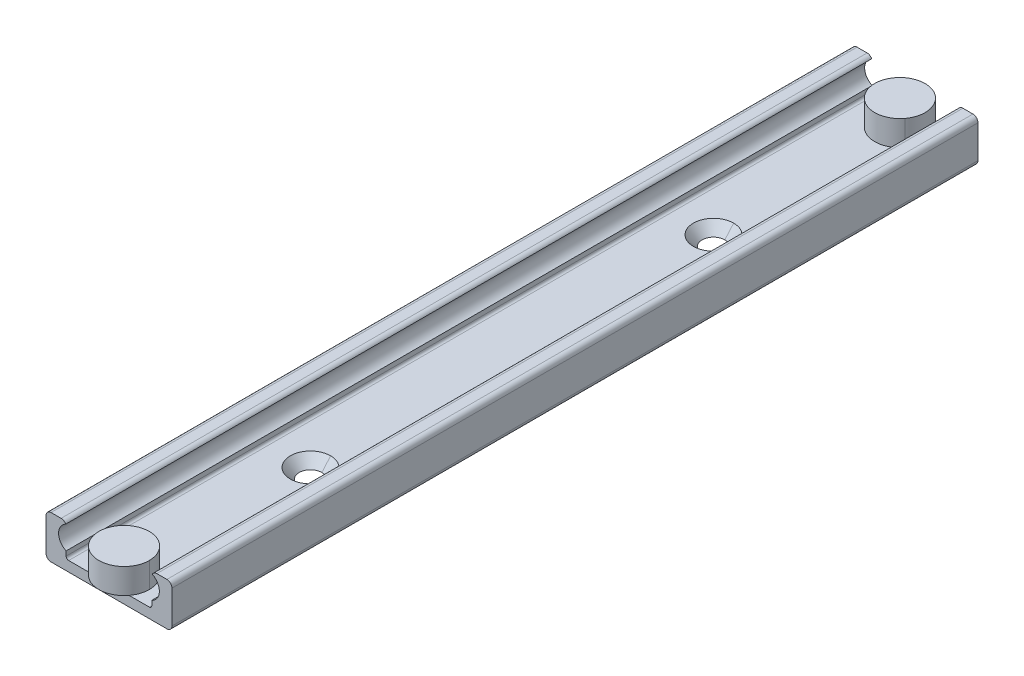
ISO-10303-21;
HEADER;
FILE_DESCRIPTION(('STEP AP214'),'2;1');
FILE_NAME('part.step','',(''),(''),'','','');
FILE_SCHEMA(('AUTOMOTIVE_DESIGN { 1 0 10303 214 1 1 1 1 }'));
ENDSEC;
DATA;
#1=APPLICATION_CONTEXT('core data for automotive mechanical design processes');
#2=APPLICATION_PROTOCOL_DEFINITION('international standard','automotive_design',2000,#1);
#3=PRODUCT_CONTEXT('',#1,'mechanical');
#4=PRODUCT('Part','Part','',(#3));
#5=PRODUCT_RELATED_PRODUCT_CATEGORY('part','',(#4));
#6=PRODUCT_DEFINITION_FORMATION('','',#4);
#7=PRODUCT_DEFINITION_CONTEXT('part definition',#1,'design');
#8=PRODUCT_DEFINITION('design','',#6,#7);
#9=PRODUCT_DEFINITION_SHAPE('','',#8);
#10=(LENGTH_UNIT() NAMED_UNIT(*) SI_UNIT(.MILLI.,.METRE.));
#11=(NAMED_UNIT(*) PLANE_ANGLE_UNIT() SI_UNIT($,.RADIAN.));
#12=(NAMED_UNIT(*) SI_UNIT($,.STERADIAN.) SOLID_ANGLE_UNIT());
#13=UNCERTAINTY_MEASURE_WITH_UNIT(LENGTH_MEASURE(1.E-05),#10,'distance_accuracy_value','');
#14=(GEOMETRIC_REPRESENTATION_CONTEXT(3) GLOBAL_UNCERTAINTY_ASSIGNED_CONTEXT((#13)) GLOBAL_UNIT_ASSIGNED_CONTEXT((#10,
#11,#12)) REPRESENTATION_CONTEXT('',''));
#15=CARTESIAN_POINT('',(0.,0.,0.));
#16=DIRECTION('',(0.,0.,1.));
#17=DIRECTION('',(1.,0.,0.));
#18=AXIS2_PLACEMENT_3D('',#15,#16,#17);
#19=CARTESIAN_POINT('',(-8.00000000000009,2.49999999999991,160.));
#20=DIRECTION('',(0.,0.,1.));
#21=DIRECTION('',(0.70710678118642,0.707106781186675,0.));
#22=AXIS2_PLACEMENT_3D('',#19,#20,#21);
#23=CYLINDRICAL_SURFACE('',#22,0.5);
#24=DIRECTION('',(0.,0.,-1.));
#25=VECTOR('',#24,1.);
#26=CARTESIAN_POINT('',(-8.,2.,160.));
#27=LINE('',#26,#25);
#28=CARTESIAN_POINT('',(-8.,2.,160.));
#29=VERTEX_POINT('',#28);
#30=CARTESIAN_POINT('',(-8.,2.,0.));
#31=VERTEX_POINT('',#30);
#32=EDGE_CURVE('E11',#29,#31,#27,.T.);
#33=ORIENTED_EDGE('',*,*,#32,.T.);
#34=CARTESIAN_POINT('',(-8.00000000000009,2.49999999999991,0.));
#35=DIRECTION('',(0.,0.,1.));
#36=DIRECTION('',(1.,0.,0.));
#37=AXIS2_PLACEMENT_3D('',#34,#35,#36);
#38=CIRCLE('',#37,0.5);
#39=CARTESIAN_POINT('',(-8.5,2.5,0.));
#40=VERTEX_POINT('',#39);
#41=EDGE_CURVE('E25',#40,#31,#38,.T.);
#42=ORIENTED_EDGE('',*,*,#41,.F.);
#43=DIRECTION('',(0.,0.,-1.));
#44=VECTOR('',#43,1.);
#45=CARTESIAN_POINT('',(-8.5,2.5,160.));
#46=LINE('',#45,#44);
#47=CARTESIAN_POINT('',(-8.5,2.5,160.));
#48=VERTEX_POINT('',#47);
#49=EDGE_CURVE('E586',#48,#40,#46,.T.);
#50=ORIENTED_EDGE('',*,*,#49,.F.);
#51=CARTESIAN_POINT('',(-8.00000000000009,2.49999999999991,160.));
#52=DIRECTION('',(0.,0.,1.));
#53=DIRECTION('',(1.,0.,0.));
#54=AXIS2_PLACEMENT_3D('',#51,#52,#53);
#55=CIRCLE('',#54,0.5);
#56=EDGE_CURVE('E582',#48,#29,#55,.T.);
#57=ORIENTED_EDGE('',*,*,#56,.T.);
#58=EDGE_LOOP('',(#33,#42,#50,#57));
#59=FACE_BOUND('',#58,.T.);
#60=ADVANCED_FACE('F17',(#59),#23,.F.);
#61=CARTESIAN_POINT('',(-11.5000000000008,0.999999999999223,160.));
#62=DIRECTION('',(0.,0.,1.));
#63=DIRECTION('',(1.,0.,0.));
#64=AXIS2_PLACEMENT_3D('',#61,#62,#63);
#65=PLANE('',#64);
#66=DIRECTION('',(0.,-1.,0.));
#67=VECTOR('',#66,1.);
#68=CARTESIAN_POINT('',(-12.5,7.5,160.));
#69=LINE('',#68,#67);
#70=CARTESIAN_POINT('',(-12.5,7.5,160.));
#71=VERTEX_POINT('',#70);
#72=CARTESIAN_POINT('',(-12.5,1.,160.));
#73=VERTEX_POINT('',#72);
#74=EDGE_CURVE('E578',#71,#73,#69,.T.);
#75=ORIENTED_EDGE('',*,*,#74,.T.);
#76=CARTESIAN_POINT('',(-11.5000000000008,0.999999999999223,160.));
#77=DIRECTION('',(0.,0.,1.));
#78=DIRECTION('',(1.,0.,0.));
#79=AXIS2_PLACEMENT_3D('',#76,#77,#78);
#80=CIRCLE('',#79,1.);
#81=CARTESIAN_POINT('',(-11.5,0.,160.));
#82=VERTEX_POINT('',#81);
#83=EDGE_CURVE('E574',#73,#82,#80,.T.);
#84=ORIENTED_EDGE('',*,*,#83,.T.);
#85=DIRECTION('',(1.,0.,0.));
#86=VECTOR('',#85,1.);
#87=CARTESIAN_POINT('',(-11.5,0.,160.));
#88=LINE('',#87,#86);
#89=CARTESIAN_POINT('',(11.5,0.,160.));
#90=VERTEX_POINT('',#89);
#91=EDGE_CURVE('E570',#82,#90,#88,.T.);
#92=ORIENTED_EDGE('',*,*,#91,.T.);
#93=CARTESIAN_POINT('',(11.5000000000008,0.999999999999223,160.));
#94=DIRECTION('',(0.,0.,1.));
#95=DIRECTION('',(1.,0.,0.));
#96=AXIS2_PLACEMENT_3D('',#93,#94,#95);
#97=CIRCLE('',#96,1.);
#98=CARTESIAN_POINT('',(12.5,1.,160.));
#99=VERTEX_POINT('',#98);
#100=EDGE_CURVE('E566',#90,#99,#97,.T.);
#101=ORIENTED_EDGE('',*,*,#100,.T.);
#102=DIRECTION('',(0.,1.,0.));
#103=VECTOR('',#102,1.);
#104=CARTESIAN_POINT('',(12.5,1.,160.));
#105=LINE('',#104,#103);
#106=CARTESIAN_POINT('',(12.5,7.5,160.));
#107=VERTEX_POINT('',#106);
#108=EDGE_CURVE('E562',#99,#107,#105,.T.);
#109=ORIENTED_EDGE('',*,*,#108,.T.);
#110=CARTESIAN_POINT('',(11.5000000000007,7.50000000000069,160.));
#111=DIRECTION('',(0.,0.,1.));
#112=DIRECTION('',(1.,0.,0.));
#113=AXIS2_PLACEMENT_3D('',#110,#111,#112);
#114=CIRCLE('',#113,1.);
#115=CARTESIAN_POINT('',(11.5,8.5,160.));
#116=VERTEX_POINT('',#115);
#117=EDGE_CURVE('E558',#107,#116,#114,.T.);
#118=ORIENTED_EDGE('',*,*,#117,.T.);
#119=DIRECTION('',(-1.,0.,0.));
#120=VECTOR('',#119,1.);
#121=CARTESIAN_POINT('',(11.5,8.5,160.));
#122=LINE('',#121,#120);
#123=CARTESIAN_POINT('',(9.5,8.5,160.));
#124=VERTEX_POINT('',#123);
#125=EDGE_CURVE('E554',#116,#124,#122,.T.);
#126=ORIENTED_EDGE('',*,*,#125,.T.);
#127=CARTESIAN_POINT('',(9.50000000000006,7.5,160.));
#128=DIRECTION('',(0.,0.,1.));
#129=DIRECTION('',(1.,0.,0.));
#130=AXIS2_PLACEMENT_3D('',#127,#128,#129);
#131=CIRCLE('',#130,1.);
#132=CARTESIAN_POINT('',(8.6035924033162,7.943230662982,160.));
#133=VERTEX_POINT('',#132);
#134=EDGE_CURVE('E550',#124,#133,#131,.T.);
#135=ORIENTED_EDGE('',*,*,#134,.T.);
#136=CARTESIAN_POINT('',(7.49999999999998,5.7,160.));
#137=DIRECTION('',(0.,0.,1.));
#138=DIRECTION('',(1.,0.,0.));
#139=AXIS2_PLACEMENT_3D('',#136,#137,#138);
#140=CIRCLE('',#139,2.5);
#141=CARTESIAN_POINT('',(8.5,3.4087121525221,160.));
#142=VERTEX_POINT('',#141);
#143=EDGE_CURVE('E545',#142,#133,#140,.T.);
#144=ORIENTED_EDGE('',*,*,#143,.F.);
#145=DIRECTION('',(0.,-1.,0.));
#146=VECTOR('',#145,1.);
#147=CARTESIAN_POINT('',(8.5,3.4087121525221,160.));
#148=LINE('',#147,#146);
#149=CARTESIAN_POINT('',(8.5,2.5,160.));
#150=VERTEX_POINT('',#149);
#151=EDGE_CURVE('E541',#142,#150,#148,.T.);
#152=ORIENTED_EDGE('',*,*,#151,.T.);
#153=CARTESIAN_POINT('',(8.00000000000009,2.49999999999991,160.));
#154=DIRECTION('',(0.,0.,1.));
#155=DIRECTION('',(1.,0.,0.));
#156=AXIS2_PLACEMENT_3D('',#153,#154,#155);
#157=CIRCLE('',#156,0.5);
#158=CARTESIAN_POINT('',(8.,2.,160.));
#159=VERTEX_POINT('',#158);
#160=EDGE_CURVE('E536',#159,#150,#157,.T.);
#161=ORIENTED_EDGE('',*,*,#160,.F.);
#162=DIRECTION('',(-1.,0.,0.));
#163=VECTOR('',#162,1.);
#164=CARTESIAN_POINT('',(8.,2.,160.));
#165=LINE('',#164,#163);
#166=CARTESIAN_POINT('',(4.,2.,160.));
#167=VERTEX_POINT('',#166);
#168=EDGE_CURVE('E532',#159,#167,#165,.T.);
#169=ORIENTED_EDGE('',*,*,#168,.T.);
#170=DIRECTION('',(-1.,0.,0.));
#171=VECTOR('',#170,1.);
#172=CARTESIAN_POINT('',(8.,2.,160.));
#173=LINE('',#172,#171);
#174=CARTESIAN_POINT('',(-4.,2.,160.));
#175=VERTEX_POINT('',#174);
#176=EDGE_CURVE('E528',#167,#175,#173,.T.);
#177=ORIENTED_EDGE('',*,*,#176,.T.);
#178=DIRECTION('',(-1.,0.,0.));
#179=VECTOR('',#178,1.);
#180=CARTESIAN_POINT('',(8.,2.,160.));
#181=LINE('',#180,#179);
#182=EDGE_CURVE('E523',#175,#29,#181,.T.);
#183=ORIENTED_EDGE('',*,*,#182,.T.);
#184=ORIENTED_EDGE('',*,*,#56,.F.);
#185=DIRECTION('',(0.,1.,0.));
#186=VECTOR('',#185,1.);
#187=CARTESIAN_POINT('',(-8.5,2.5,160.));
#188=LINE('',#187,#186);
#189=CARTESIAN_POINT('',(-8.5,3.4087121525221,160.));
#190=VERTEX_POINT('',#189);
#191=EDGE_CURVE('E519',#48,#190,#188,.T.);
#192=ORIENTED_EDGE('',*,*,#191,.T.);
#193=CARTESIAN_POINT('',(-7.49999999999998,5.7,160.));
#194=DIRECTION('',(0.,0.,1.));
#195=DIRECTION('',(1.,0.,0.));
#196=AXIS2_PLACEMENT_3D('',#193,#194,#195);
#197=CIRCLE('',#196,2.5);
#198=CARTESIAN_POINT('',(-8.6035924033162,7.943230662982,160.));
#199=VERTEX_POINT('',#198);
#200=EDGE_CURVE('E514',#199,#190,#197,.T.);
#201=ORIENTED_EDGE('',*,*,#200,.F.);
#202=CARTESIAN_POINT('',(-9.50000000000006,7.5,160.));
#203=DIRECTION('',(0.,0.,1.));
#204=DIRECTION('',(1.,0.,0.));
#205=AXIS2_PLACEMENT_3D('',#202,#203,#204);
#206=CIRCLE('',#205,1.);
#207=CARTESIAN_POINT('',(-9.5,8.5,160.));
#208=VERTEX_POINT('',#207);
#209=EDGE_CURVE('E510',#199,#208,#206,.T.);
#210=ORIENTED_EDGE('',*,*,#209,.T.);
#211=DIRECTION('',(-1.,0.,0.));
#212=VECTOR('',#211,1.);
#213=CARTESIAN_POINT('',(-9.5,8.5,160.));
#214=LINE('',#213,#212);
#215=CARTESIAN_POINT('',(-11.5,8.5,160.));
#216=VERTEX_POINT('',#215);
#217=EDGE_CURVE('E506',#208,#216,#214,.T.);
#218=ORIENTED_EDGE('',*,*,#217,.T.);
#219=CARTESIAN_POINT('',(-11.5000000000007,7.50000000000069,160.));
#220=DIRECTION('',(0.,0.,1.));
#221=DIRECTION('',(1.,0.,0.));
#222=AXIS2_PLACEMENT_3D('',#219,#220,#221);
#223=CIRCLE('',#222,1.);
#224=EDGE_CURVE('E502',#216,#71,#223,.T.);
#225=ORIENTED_EDGE('',*,*,#224,.T.);
#226=EDGE_LOOP('',(#75,#84,#92,#101,#109,#118,#126,#135,#144,#152,#161,#169,#177,#183,#184,#192,
#201,#210,#218,#225));
#227=FACE_BOUND('',#226,.T.);
#228=ADVANCED_FACE('F678',(#227),#65,.T.);
#229=CARTESIAN_POINT('',(-11.5000000000007,7.50000000000069,160.));
#230=DIRECTION('',(0.,0.,1.));
#231=DIRECTION('',(0.707106781186544,-0.707106781186551,0.));
#232=AXIS2_PLACEMENT_3D('',#229,#230,#231);
#233=CYLINDRICAL_SURFACE('',#232,1.);
#234=CARTESIAN_POINT('',(-11.5000000000007,7.50000000000069,0.));
#235=DIRECTION('',(0.,0.,1.));
#236=DIRECTION('',(1.,0.,0.));
#237=AXIS2_PLACEMENT_3D('',#234,#235,#236);
#238=CIRCLE('',#237,1.);
#239=CARTESIAN_POINT('',(-11.5,8.5,0.));
#240=VERTEX_POINT('',#239);
#241=CARTESIAN_POINT('',(-12.5,7.5,0.));
#242=VERTEX_POINT('',#241);
#243=EDGE_CURVE('E498',#240,#242,#238,.T.);
#244=ORIENTED_EDGE('',*,*,#243,.T.);
#245=DIRECTION('',(0.,0.,-1.));
#246=VECTOR('',#245,1.);
#247=CARTESIAN_POINT('',(-12.5,7.5,160.));
#248=LINE('',#247,#246);
#249=EDGE_CURVE('E493',#71,#242,#248,.T.);
#250=ORIENTED_EDGE('',*,*,#249,.F.);
#251=ORIENTED_EDGE('',*,*,#224,.F.);
#252=DIRECTION('',(0.,0.,-1.));
#253=VECTOR('',#252,1.);
#254=CARTESIAN_POINT('',(-11.5,8.5,160.));
#255=LINE('',#254,#253);
#256=EDGE_CURVE('E489',#216,#240,#255,.T.);
#257=ORIENTED_EDGE('',*,*,#256,.T.);
#258=EDGE_LOOP('',(#244,#250,#251,#257));
#259=FACE_BOUND('',#258,.T.);
#260=ADVANCED_FACE('F659',(#259),#233,.T.);
#261=CARTESIAN_POINT('',(-9.5,8.5,160.));
#262=DIRECTION('',(0.,-1.,0.));
#263=DIRECTION('',(0.,0.,-1.));
#264=AXIS2_PLACEMENT_3D('',#261,#262,#263);
#265=PLANE('',#264);
#266=DIRECTION('',(-1.,0.,0.));
#267=VECTOR('',#266,1.);
#268=CARTESIAN_POINT('',(-9.5,8.5,0.));
#269=LINE('',#268,#267);
#270=CARTESIAN_POINT('',(-9.5,8.5,0.));
#271=VERTEX_POINT('',#270);
#272=EDGE_CURVE('E484',#271,#240,#269,.T.);
#273=ORIENTED_EDGE('',*,*,#272,.T.);
#274=ORIENTED_EDGE('',*,*,#256,.F.);
#275=ORIENTED_EDGE('',*,*,#217,.F.);
#276=DIRECTION('',(0.,0.,-1.));
#277=VECTOR('',#276,1.);
#278=CARTESIAN_POINT('',(-9.5,8.5,160.));
#279=LINE('',#278,#277);
#280=EDGE_CURVE('E480',#208,#271,#279,.T.);
#281=ORIENTED_EDGE('',*,*,#280,.T.);
#282=EDGE_LOOP('',(#273,#274,#275,#281));
#283=FACE_BOUND('',#282,.T.);
#284=ADVANCED_FACE('F664',(#283),#265,.F.);
#285=CARTESIAN_POINT('',(-9.50000000000006,7.5,160.));
#286=DIRECTION('',(0.,0.,1.));
#287=DIRECTION('',(-0.527621709664251,-0.849479447362309,0.));
#288=AXIS2_PLACEMENT_3D('',#285,#286,#287);
#289=CYLINDRICAL_SURFACE('',#288,1.);
#290=CARTESIAN_POINT('',(-9.50000000000006,7.5,0.));
#291=DIRECTION('',(0.,0.,1.));
#292=DIRECTION('',(1.,0.,0.));
#293=AXIS2_PLACEMENT_3D('',#290,#291,#292);
#294=CIRCLE('',#293,1.);
#295=CARTESIAN_POINT('',(-8.6035924033162,7.943230662982,0.));
#296=VERTEX_POINT('',#295);
#297=EDGE_CURVE('E475',#296,#271,#294,.T.);
#298=ORIENTED_EDGE('',*,*,#297,.T.);
#299=ORIENTED_EDGE('',*,*,#280,.F.);
#300=ORIENTED_EDGE('',*,*,#209,.F.);
#301=DIRECTION('',(0.,0.,-1.));
#302=VECTOR('',#301,1.);
#303=CARTESIAN_POINT('',(-8.6035924033162,7.943230662982,160.));
#304=LINE('',#303,#302);
#305=EDGE_CURVE('E471',#199,#296,#304,.T.);
#306=ORIENTED_EDGE('',*,*,#305,.T.);
#307=EDGE_LOOP('',(#298,#299,#300,#306));
#308=FACE_BOUND('',#307,.T.);
#309=ADVANCED_FACE('F668',(#308),#289,.T.);
#310=CARTESIAN_POINT('',(-7.49999999999998,5.7,160.));
#311=DIRECTION('',(0.,0.,1.));
#312=DIRECTION('',(0.999739148398091,0.0228393336211892,0.));
#313=AXIS2_PLACEMENT_3D('',#310,#311,#312);
#314=CYLINDRICAL_SURFACE('',#313,2.5);
#315=DIRECTION('',(0.,0.,-1.));
#316=VECTOR('',#315,1.);
#317=CARTESIAN_POINT('',(-8.5,3.4087121525221,160.));
#318=LINE('',#317,#316);
#319=CARTESIAN_POINT('',(-8.5,3.4087121525221,0.));
#320=VERTEX_POINT('',#319);
#321=EDGE_CURVE('E467',#190,#320,#318,.T.);
#322=ORIENTED_EDGE('',*,*,#321,.T.);
#323=CARTESIAN_POINT('',(-7.49999999999998,5.7,0.));
#324=DIRECTION('',(0.,0.,1.));
#325=DIRECTION('',(1.,0.,0.));
#326=AXIS2_PLACEMENT_3D('',#323,#324,#325);
#327=CIRCLE('',#326,2.5);
#328=EDGE_CURVE('E462',#296,#320,#327,.T.);
#329=ORIENTED_EDGE('',*,*,#328,.F.);
#330=ORIENTED_EDGE('',*,*,#305,.F.);
#331=ORIENTED_EDGE('',*,*,#200,.T.);
#332=EDGE_LOOP('',(#322,#329,#330,#331));
#333=FACE_BOUND('',#332,.T.);
#334=ADVANCED_FACE('F711',(#333),#314,.F.);
#335=CARTESIAN_POINT('',(-11.5000000000008,0.999999999999223,0.));
#336=DIRECTION('',(0.,0.,1.));
#337=DIRECTION('',(1.,0.,0.));
#338=AXIS2_PLACEMENT_3D('',#335,#336,#337);
#339=PLANE('',#338);
#340=DIRECTION('',(0.,-1.,0.));
#341=VECTOR('',#340,1.);
#342=CARTESIAN_POINT('',(-12.5,7.5,0.));
#343=LINE('',#342,#341);
#344=CARTESIAN_POINT('',(-12.5,1.,0.));
#345=VERTEX_POINT('',#344);
#346=EDGE_CURVE('E457',#242,#345,#343,.T.);
#347=ORIENTED_EDGE('',*,*,#346,.F.);
#348=ORIENTED_EDGE('',*,*,#243,.F.);
#349=ORIENTED_EDGE('',*,*,#272,.F.);
#350=ORIENTED_EDGE('',*,*,#297,.F.);
#351=ORIENTED_EDGE('',*,*,#328,.T.);
#352=DIRECTION('',(0.,1.,0.));
#353=VECTOR('',#352,1.);
#354=CARTESIAN_POINT('',(-8.5,2.5,0.));
#355=LINE('',#354,#353);
#356=EDGE_CURVE('E452',#40,#320,#355,.T.);
#357=ORIENTED_EDGE('',*,*,#356,.F.);
#358=ORIENTED_EDGE('',*,*,#41,.T.);
#359=DIRECTION('',(-1.,0.,0.));
#360=VECTOR('',#359,1.);
#361=CARTESIAN_POINT('',(8.,2.,0.));
#362=LINE('',#361,#360);
#363=CARTESIAN_POINT('',(-4.,2.,0.));
#364=VERTEX_POINT('',#363);
#365=EDGE_CURVE('E447',#364,#31,#362,.T.);
#366=ORIENTED_EDGE('',*,*,#365,.F.);
#367=DIRECTION('',(-1.,0.,0.));
#368=VECTOR('',#367,1.);
#369=CARTESIAN_POINT('',(8.,2.,0.));
#370=LINE('',#369,#368);
#371=CARTESIAN_POINT('',(4.,2.,0.));
#372=VERTEX_POINT('',#371);
#373=EDGE_CURVE('E442',#372,#364,#370,.T.);
#374=ORIENTED_EDGE('',*,*,#373,.F.);
#375=DIRECTION('',(-1.,0.,0.));
#376=VECTOR('',#375,1.);
#377=CARTESIAN_POINT('',(8.,2.,0.));
#378=LINE('',#377,#376);
#379=CARTESIAN_POINT('',(8.,2.,0.));
#380=VERTEX_POINT('',#379);
#381=EDGE_CURVE('E437',#380,#372,#378,.T.);
#382=ORIENTED_EDGE('',*,*,#381,.F.);
#383=CARTESIAN_POINT('',(8.00000000000009,2.49999999999991,0.));
#384=DIRECTION('',(0.,0.,1.));
#385=DIRECTION('',(1.,0.,0.));
#386=AXIS2_PLACEMENT_3D('',#383,#384,#385);
#387=CIRCLE('',#386,0.5);
#388=CARTESIAN_POINT('',(8.5,2.5,0.));
#389=VERTEX_POINT('',#388);
#390=EDGE_CURVE('E433',#380,#389,#387,.T.);
#391=ORIENTED_EDGE('',*,*,#390,.T.);
#392=DIRECTION('',(0.,-1.,0.));
#393=VECTOR('',#392,1.);
#394=CARTESIAN_POINT('',(8.5,3.4087121525221,0.));
#395=LINE('',#394,#393);
#396=CARTESIAN_POINT('',(8.5,3.4087121525221,0.));
#397=VERTEX_POINT('',#396);
#398=EDGE_CURVE('E428',#397,#389,#395,.T.);
#399=ORIENTED_EDGE('',*,*,#398,.F.);
#400=CARTESIAN_POINT('',(7.49999999999998,5.7,0.));
#401=DIRECTION('',(0.,0.,1.));
#402=DIRECTION('',(1.,0.,0.));
#403=AXIS2_PLACEMENT_3D('',#400,#401,#402);
#404=CIRCLE('',#403,2.5);
#405=CARTESIAN_POINT('',(8.6035924033162,7.943230662982,0.));
#406=VERTEX_POINT('',#405);
#407=EDGE_CURVE('E424',#397,#406,#404,.T.);
#408=ORIENTED_EDGE('',*,*,#407,.T.);
#409=CARTESIAN_POINT('',(9.50000000000006,7.5,0.));
#410=DIRECTION('',(0.,0.,1.));
#411=DIRECTION('',(1.,0.,0.));
#412=AXIS2_PLACEMENT_3D('',#409,#410,#411);
#413=CIRCLE('',#412,1.);
#414=CARTESIAN_POINT('',(9.5,8.5,0.));
#415=VERTEX_POINT('',#414);
#416=EDGE_CURVE('E419',#415,#406,#413,.T.);
#417=ORIENTED_EDGE('',*,*,#416,.F.);
#418=DIRECTION('',(-1.,0.,0.));
#419=VECTOR('',#418,1.);
#420=CARTESIAN_POINT('',(11.5,8.5,0.));
#421=LINE('',#420,#419);
#422=CARTESIAN_POINT('',(11.5,8.5,0.));
#423=VERTEX_POINT('',#422);
#424=EDGE_CURVE('E414',#423,#415,#421,.T.);
#425=ORIENTED_EDGE('',*,*,#424,.F.);
#426=CARTESIAN_POINT('',(11.5000000000007,7.50000000000069,0.));
#427=DIRECTION('',(0.,0.,1.));
#428=DIRECTION('',(1.,0.,0.));
#429=AXIS2_PLACEMENT_3D('',#426,#427,#428);
#430=CIRCLE('',#429,1.);
#431=CARTESIAN_POINT('',(12.5,7.5,0.));
#432=VERTEX_POINT('',#431);
#433=EDGE_CURVE('E409',#432,#423,#430,.T.);
#434=ORIENTED_EDGE('',*,*,#433,.F.);
#435=DIRECTION('',(0.,1.,0.));
#436=VECTOR('',#435,1.);
#437=CARTESIAN_POINT('',(12.5,1.,0.));
#438=LINE('',#437,#436);
#439=CARTESIAN_POINT('',(12.5,1.,0.));
#440=VERTEX_POINT('',#439);
#441=EDGE_CURVE('E404',#440,#432,#438,.T.);
#442=ORIENTED_EDGE('',*,*,#441,.F.);
#443=CARTESIAN_POINT('',(11.5000000000008,0.999999999999223,0.));
#444=DIRECTION('',(0.,0.,1.));
#445=DIRECTION('',(1.,0.,0.));
#446=AXIS2_PLACEMENT_3D('',#443,#444,#445);
#447=CIRCLE('',#446,1.);
#448=CARTESIAN_POINT('',(11.5,0.,0.));
#449=VERTEX_POINT('',#448);
#450=EDGE_CURVE('E399',#449,#440,#447,.T.);
#451=ORIENTED_EDGE('',*,*,#450,.F.);
#452=DIRECTION('',(1.,0.,0.));
#453=VECTOR('',#452,1.);
#454=CARTESIAN_POINT('',(-11.5,0.,0.));
#455=LINE('',#454,#453);
#456=CARTESIAN_POINT('',(-11.5,0.,0.));
#457=VERTEX_POINT('',#456);
#458=EDGE_CURVE('E394',#457,#449,#455,.T.);
#459=ORIENTED_EDGE('',*,*,#458,.F.);
#460=CARTESIAN_POINT('',(-11.5000000000008,0.999999999999223,0.));
#461=DIRECTION('',(0.,0.,1.));
#462=DIRECTION('',(1.,0.,0.));
#463=AXIS2_PLACEMENT_3D('',#460,#461,#462);
#464=CIRCLE('',#463,1.);
#465=EDGE_CURVE('E389',#345,#457,#464,.T.);
#466=ORIENTED_EDGE('',*,*,#465,.F.);
#467=EDGE_LOOP('',(#347,#348,#349,#350,#351,#357,#358,#366,#374,#382,#391,#399,#408,#417,#425,
#434,#442,#451,#459,#466));
#468=FACE_BOUND('',#467,.T.);
#469=ADVANCED_FACE('F597',(#468),#339,.F.);
#470=CARTESIAN_POINT('',(-11.5000000000008,0.999999999999223,160.));
#471=DIRECTION('',(0.,0.,1.));
#472=DIRECTION('',(0.70710678118599,0.707106781187105,0.));
#473=AXIS2_PLACEMENT_3D('',#470,#471,#472);
#474=CYLINDRICAL_SURFACE('',#473,1.);
#475=ORIENTED_EDGE('',*,*,#465,.T.);
#476=DIRECTION('',(0.,0.,-1.));
#477=VECTOR('',#476,1.);
#478=CARTESIAN_POINT('',(-11.5,0.,160.));
#479=LINE('',#478,#477);
#480=EDGE_CURVE('E384',#82,#457,#479,.T.);
#481=ORIENTED_EDGE('',*,*,#480,.F.);
#482=ORIENTED_EDGE('',*,*,#83,.F.);
#483=DIRECTION('',(0.,0.,-1.));
#484=VECTOR('',#483,1.);
#485=CARTESIAN_POINT('',(-12.5,1.,160.));
#486=LINE('',#485,#484);
#487=EDGE_CURVE('E379',#73,#345,#486,.T.);
#488=ORIENTED_EDGE('',*,*,#487,.T.);
#489=EDGE_LOOP('',(#475,#481,#482,#488));
#490=FACE_BOUND('',#489,.T.);
#491=ADVANCED_FACE('F648',(#490),#474,.T.);
#492=CARTESIAN_POINT('',(-12.5,7.5,160.));
#493=DIRECTION('',(1.,0.,0.));
#494=DIRECTION('',(0.,0.,-1.));
#495=AXIS2_PLACEMENT_3D('',#492,#493,#494);
#496=PLANE('',#495);
#497=ORIENTED_EDGE('',*,*,#346,.T.);
#498=ORIENTED_EDGE('',*,*,#487,.F.);
#499=ORIENTED_EDGE('',*,*,#74,.F.);
#500=ORIENTED_EDGE('',*,*,#249,.T.);
#501=EDGE_LOOP('',(#497,#498,#499,#500));
#502=FACE_BOUND('',#501,.T.);
#503=ADVANCED_FACE('F653',(#502),#496,.F.);
#504=CARTESIAN_POINT('',(-11.5,0.,160.));
#505=DIRECTION('',(0.,1.,0.));
#506=DIRECTION('',(0.,0.,1.));
#507=AXIS2_PLACEMENT_3D('',#504,#505,#506);
#508=PLANE('',#507);
#509=CARTESIAN_POINT('',(0.,0.,120.));
#510=DIRECTION('',(0.,-1.,0.));
#511=DIRECTION('',(0.,0.,-1.));
#512=AXIS2_PLACEMENT_3D('',#509,#510,#511);
#513=CIRCLE('',#512,2.25);
#514=CARTESIAN_POINT('',(0.,0.,117.75));
#515=VERTEX_POINT('',#514);
#516=CARTESIAN_POINT('',(0.,-3.78430620173731E-11,122.250000000043));
#517=VERTEX_POINT('',#516);
#518=EDGE_CURVE('E374',#515,#517,#513,.T.);
#519=ORIENTED_EDGE('',*,*,#518,.F.);
#520=CARTESIAN_POINT('',(0.,0.,120.));
#521=DIRECTION('',(0.,-1.,0.));
#522=DIRECTION('',(0.,0.,-1.));
#523=AXIS2_PLACEMENT_3D('',#520,#521,#522);
#524=CIRCLE('',#523,2.25);
#525=EDGE_CURVE('E369',#517,#515,#524,.T.);
#526=ORIENTED_EDGE('',*,*,#525,.F.);
#527=EDGE_LOOP('',(#519,#526));
#528=FACE_BOUND('',#527,.T.);
#529=CARTESIAN_POINT('',(0.,0.,40.));
#530=DIRECTION('',(0.,-1.,0.));
#531=DIRECTION('',(0.,0.,-1.));
#532=AXIS2_PLACEMENT_3D('',#529,#530,#531);
#533=CIRCLE('',#532,2.25);
#534=CARTESIAN_POINT('',(0.,0.,37.75));
#535=VERTEX_POINT('',#534);
#536=CARTESIAN_POINT('',(0.,-3.78430620173731E-11,42.2500000000433));
#537=VERTEX_POINT('',#536);
#538=EDGE_CURVE('E364',#535,#537,#533,.T.);
#539=ORIENTED_EDGE('',*,*,#538,.F.);
#540=CARTESIAN_POINT('',(0.,0.,40.));
#541=DIRECTION('',(0.,-1.,0.));
#542=DIRECTION('',(0.,0.,-1.));
#543=AXIS2_PLACEMENT_3D('',#540,#541,#542);
#544=CIRCLE('',#543,2.25);
#545=EDGE_CURVE('E359',#537,#535,#544,.T.);
#546=ORIENTED_EDGE('',*,*,#545,.F.);
#547=EDGE_LOOP('',(#539,#546));
#548=FACE_BOUND('',#547,.T.);
#549=ORIENTED_EDGE('',*,*,#458,.T.);
#550=DIRECTION('',(0.,0.,-1.));
#551=VECTOR('',#550,1.);
#552=CARTESIAN_POINT('',(11.5,0.,160.));
#553=LINE('',#552,#551);
#554=EDGE_CURVE('E354',#90,#449,#553,.T.);
#555=ORIENTED_EDGE('',*,*,#554,.F.);
#556=ORIENTED_EDGE('',*,*,#91,.F.);
#557=ORIENTED_EDGE('',*,*,#480,.T.);
#558=EDGE_LOOP('',(#549,#555,#556,#557));
#559=FACE_BOUND('',#558,.T.);
#560=ADVANCED_FACE('F645',(#528,#548,#559),#508,.F.);
#561=CARTESIAN_POINT('',(11.5000000000008,0.999999999999223,160.));
#562=DIRECTION('',(0.,0.,1.));
#563=DIRECTION('',(-0.70710678118654,0.707106781186556,0.));
#564=AXIS2_PLACEMENT_3D('',#561,#562,#563);
#565=CYLINDRICAL_SURFACE('',#564,1.);
#566=ORIENTED_EDGE('',*,*,#450,.T.);
#567=DIRECTION('',(0.,0.,-1.));
#568=VECTOR('',#567,1.);
#569=CARTESIAN_POINT('',(12.5,1.,160.));
#570=LINE('',#569,#568);
#571=EDGE_CURVE('E349',#99,#440,#570,.T.);
#572=ORIENTED_EDGE('',*,*,#571,.F.);
#573=ORIENTED_EDGE('',*,*,#100,.F.);
#574=ORIENTED_EDGE('',*,*,#554,.T.);
#575=EDGE_LOOP('',(#566,#572,#573,#574));
#576=FACE_BOUND('',#575,.T.);
#577=ADVANCED_FACE('F640',(#576),#565,.T.);
#578=CARTESIAN_POINT('',(12.5,1.,160.));
#579=DIRECTION('',(-1.,0.,0.));
#580=DIRECTION('',(0.,0.,1.));
#581=AXIS2_PLACEMENT_3D('',#578,#579,#580);
#582=PLANE('',#581);
#583=ORIENTED_EDGE('',*,*,#441,.T.);
#584=DIRECTION('',(0.,0.,-1.));
#585=VECTOR('',#584,1.);
#586=CARTESIAN_POINT('',(12.5,7.5,160.));
#587=LINE('',#586,#585);
#588=EDGE_CURVE('E344',#107,#432,#587,.T.);
#589=ORIENTED_EDGE('',*,*,#588,.F.);
#590=ORIENTED_EDGE('',*,*,#108,.F.);
#591=ORIENTED_EDGE('',*,*,#571,.T.);
#592=EDGE_LOOP('',(#583,#589,#590,#591));
#593=FACE_BOUND('',#592,.T.);
#594=ADVANCED_FACE('F637',(#593),#582,.F.);
#595=CARTESIAN_POINT('',(11.5000000000007,7.50000000000069,160.));
#596=DIRECTION('',(0.,0.,1.));
#597=DIRECTION('',(-0.707106781186544,-0.707106781186551,0.));
#598=AXIS2_PLACEMENT_3D('',#595,#596,#597);
#599=CYLINDRICAL_SURFACE('',#598,1.);
#600=ORIENTED_EDGE('',*,*,#433,.T.);
#601=DIRECTION('',(0.,0.,-1.));
#602=VECTOR('',#601,1.);
#603=CARTESIAN_POINT('',(11.5,8.5,160.));
#604=LINE('',#603,#602);
#605=EDGE_CURVE('E339',#116,#423,#604,.T.);
#606=ORIENTED_EDGE('',*,*,#605,.F.);
#607=ORIENTED_EDGE('',*,*,#117,.F.);
#608=ORIENTED_EDGE('',*,*,#588,.T.);
#609=EDGE_LOOP('',(#600,#606,#607,#608));
#610=FACE_BOUND('',#609,.T.);
#611=ADVANCED_FACE('F632',(#610),#599,.T.);
#612=CARTESIAN_POINT('',(11.5,8.5,160.));
#613=DIRECTION('',(0.,-1.,0.));
#614=DIRECTION('',(0.,0.,-1.));
#615=AXIS2_PLACEMENT_3D('',#612,#613,#614);
#616=PLANE('',#615);
#617=ORIENTED_EDGE('',*,*,#424,.T.);
#618=DIRECTION('',(0.,0.,-1.));
#619=VECTOR('',#618,1.);
#620=CARTESIAN_POINT('',(9.5,8.5,160.));
#621=LINE('',#620,#619);
#622=EDGE_CURVE('E334',#124,#415,#621,.T.);
#623=ORIENTED_EDGE('',*,*,#622,.F.);
#624=ORIENTED_EDGE('',*,*,#125,.F.);
#625=ORIENTED_EDGE('',*,*,#605,.T.);
#626=EDGE_LOOP('',(#617,#623,#624,#625));
#627=FACE_BOUND('',#626,.T.);
#628=ADVANCED_FACE('F629',(#627),#616,.F.);
#629=CARTESIAN_POINT('',(9.50000000000006,7.5,160.));
#630=DIRECTION('',(0.,0.,1.));
#631=DIRECTION('',(0.527621709664251,-0.849479447362309,0.));
#632=AXIS2_PLACEMENT_3D('',#629,#630,#631);
#633=CYLINDRICAL_SURFACE('',#632,1.);
#634=ORIENTED_EDGE('',*,*,#416,.T.);
#635=DIRECTION('',(0.,0.,-1.));
#636=VECTOR('',#635,1.);
#637=CARTESIAN_POINT('',(8.6035924033162,7.943230662982,160.));
#638=LINE('',#637,#636);
#639=EDGE_CURVE('E329',#133,#406,#638,.T.);
#640=ORIENTED_EDGE('',*,*,#639,.F.);
#641=ORIENTED_EDGE('',*,*,#134,.F.);
#642=ORIENTED_EDGE('',*,*,#622,.T.);
#643=EDGE_LOOP('',(#634,#640,#641,#642));
#644=FACE_BOUND('',#643,.T.);
#645=ADVANCED_FACE('F624',(#644),#633,.T.);
#646=CARTESIAN_POINT('',(7.49999999999998,5.7,160.));
#647=DIRECTION('',(0.,0.,1.));
#648=DIRECTION('',(-0.999739148398091,0.0228393336211896,0.));
#649=AXIS2_PLACEMENT_3D('',#646,#647,#648);
#650=CYLINDRICAL_SURFACE('',#649,2.5);
#651=ORIENTED_EDGE('',*,*,#639,.T.);
#652=ORIENTED_EDGE('',*,*,#407,.F.);
#653=DIRECTION('',(0.,0.,-1.));
#654=VECTOR('',#653,1.);
#655=CARTESIAN_POINT('',(8.5,3.4087121525221,160.));
#656=LINE('',#655,#654);
#657=EDGE_CURVE('E324',#142,#397,#656,.T.);
#658=ORIENTED_EDGE('',*,*,#657,.F.);
#659=ORIENTED_EDGE('',*,*,#143,.T.);
#660=EDGE_LOOP('',(#651,#652,#658,#659));
#661=FACE_BOUND('',#660,.T.);
#662=ADVANCED_FACE('F621',(#661),#650,.F.);
#663=CARTESIAN_POINT('',(8.5,3.4087121525221,160.));
#664=DIRECTION('',(1.,0.,0.));
#665=DIRECTION('',(0.,0.,-1.));
#666=AXIS2_PLACEMENT_3D('',#663,#664,#665);
#667=PLANE('',#666);
#668=ORIENTED_EDGE('',*,*,#398,.T.);
#669=DIRECTION('',(0.,0.,-1.));
#670=VECTOR('',#669,1.);
#671=CARTESIAN_POINT('',(8.5,2.5,160.));
#672=LINE('',#671,#670);
#673=EDGE_CURVE('E319',#150,#389,#672,.T.);
#674=ORIENTED_EDGE('',*,*,#673,.F.);
#675=ORIENTED_EDGE('',*,*,#151,.F.);
#676=ORIENTED_EDGE('',*,*,#657,.T.);
#677=EDGE_LOOP('',(#668,#674,#675,#676));
#678=FACE_BOUND('',#677,.T.);
#679=ADVANCED_FACE('F617',(#678),#667,.F.);
#680=CARTESIAN_POINT('',(8.00000000000009,2.49999999999991,160.));
#681=DIRECTION('',(0.,0.,1.));
#682=DIRECTION('',(-0.707106781186547,0.707106781186548,0.));
#683=AXIS2_PLACEMENT_3D('',#680,#681,#682);
#684=CYLINDRICAL_SURFACE('',#683,0.5);
#685=ORIENTED_EDGE('',*,*,#673,.T.);
#686=ORIENTED_EDGE('',*,*,#390,.F.);
#687=DIRECTION('',(0.,0.,-1.));
#688=VECTOR('',#687,1.);
#689=CARTESIAN_POINT('',(8.,2.,160.));
#690=LINE('',#689,#688);
#691=EDGE_CURVE('E314',#159,#380,#690,.T.);
#692=ORIENTED_EDGE('',*,*,#691,.F.);
#693=ORIENTED_EDGE('',*,*,#160,.T.);
#694=EDGE_LOOP('',(#685,#686,#692,#693));
#695=FACE_BOUND('',#694,.T.);
#696=ADVANCED_FACE('F613',(#695),#684,.F.);
#697=CARTESIAN_POINT('',(8.,2.,160.));
#698=DIRECTION('',(0.,-1.,0.));
#699=DIRECTION('',(0.,0.,-1.));
#700=AXIS2_PLACEMENT_3D('',#697,#698,#699);
#701=PLANE('',#700);
#702=CARTESIAN_POINT('',(0.,2.,157.));
#703=DIRECTION('',(0.,1.,0.));
#704=DIRECTION('',(1.,0.,0.));
#705=AXIS2_PLACEMENT_3D('',#702,#703,#704);
#706=CIRCLE('',#705,5.);
#707=CARTESIAN_POINT('',(5.,2.,157.));
#708=VERTEX_POINT('',#707);
#709=EDGE_CURVE('E309',#167,#708,#706,.T.);
#710=ORIENTED_EDGE('',*,*,#709,.F.);
#711=ORIENTED_EDGE('',*,*,#168,.F.);
#712=ORIENTED_EDGE('',*,*,#691,.T.);
#713=ORIENTED_EDGE('',*,*,#381,.T.);
#714=CARTESIAN_POINT('',(0.,2.,3.));
#715=DIRECTION('',(0.,1.,0.));
#716=DIRECTION('',(1.,0.,0.));
#717=AXIS2_PLACEMENT_3D('',#714,#715,#716);
#718=CIRCLE('',#717,5.);
#719=CARTESIAN_POINT('',(4.,2.,6.));
#720=VERTEX_POINT('',#719);
#721=EDGE_CURVE('E305',#720,#372,#718,.T.);
#722=ORIENTED_EDGE('',*,*,#721,.F.);
#723=CARTESIAN_POINT('',(0.,2.,3.));
#724=DIRECTION('',(0.,1.,0.));
#725=DIRECTION('',(1.,0.,0.));
#726=AXIS2_PLACEMENT_3D('',#723,#724,#725);
#727=CIRCLE('',#726,5.);
#728=EDGE_CURVE('E300',#364,#720,#727,.T.);
#729=ORIENTED_EDGE('',*,*,#728,.F.);
#730=ORIENTED_EDGE('',*,*,#365,.T.);
#731=ORIENTED_EDGE('',*,*,#32,.F.);
#732=ORIENTED_EDGE('',*,*,#182,.F.);
#733=CARTESIAN_POINT('',(0.,2.,157.));
#734=DIRECTION('',(0.,1.,0.));
#735=DIRECTION('',(1.,0.,0.));
#736=AXIS2_PLACEMENT_3D('',#733,#734,#735);
#737=CIRCLE('',#736,5.);
#738=CARTESIAN_POINT('',(-5.,2.,157.));
#739=VERTEX_POINT('',#738);
#740=EDGE_CURVE('E295',#739,#175,#737,.T.);
#741=ORIENTED_EDGE('',*,*,#740,.F.);
#742=CARTESIAN_POINT('',(0.,2.,157.));
#743=DIRECTION('',(0.,1.,0.));
#744=DIRECTION('',(1.,0.,0.));
#745=AXIS2_PLACEMENT_3D('',#742,#743,#744);
#746=CIRCLE('',#745,5.);
#747=EDGE_CURVE('E290',#708,#739,#746,.T.);
#748=ORIENTED_EDGE('',*,*,#747,.F.);
#749=EDGE_LOOP('',(#710,#711,#712,#713,#722,#729,#730,#731,#732,#741,#748));
#750=FACE_BOUND('',#749,.T.);
#751=CARTESIAN_POINT('',(0.,2.,120.));
#752=DIRECTION('',(0.,-1.,0.));
#753=DIRECTION('',(0.,0.,-1.));
#754=AXIS2_PLACEMENT_3D('',#751,#752,#753);
#755=CIRCLE('',#754,4.);
#756=CARTESIAN_POINT('',(0.,2.,116.));
#757=VERTEX_POINT('',#756);
#758=CARTESIAN_POINT('',(0.,2.,124.));
#759=VERTEX_POINT('',#758);
#760=EDGE_CURVE('E286',#757,#759,#755,.T.);
#761=ORIENTED_EDGE('',*,*,#760,.T.);
#762=CARTESIAN_POINT('',(0.,2.,120.));
#763=DIRECTION('',(0.,-1.,0.));
#764=DIRECTION('',(0.,0.,-1.));
#765=AXIS2_PLACEMENT_3D('',#762,#763,#764);
#766=CIRCLE('',#765,4.);
#767=EDGE_CURVE('E282',#759,#757,#766,.T.);
#768=ORIENTED_EDGE('',*,*,#767,.T.);
#769=EDGE_LOOP('',(#761,#768));
#770=FACE_BOUND('',#769,.T.);
#771=CARTESIAN_POINT('',(0.,2.,40.));
#772=DIRECTION('',(0.,-1.,0.));
#773=DIRECTION('',(0.,0.,-1.));
#774=AXIS2_PLACEMENT_3D('',#771,#772,#773);
#775=CIRCLE('',#774,4.);
#776=CARTESIAN_POINT('',(0.,2.,36.));
#777=VERTEX_POINT('',#776);
#778=CARTESIAN_POINT('',(0.,2.,44.));
#779=VERTEX_POINT('',#778);
#780=EDGE_CURVE('E278',#777,#779,#775,.T.);
#781=ORIENTED_EDGE('',*,*,#780,.T.);
#782=CARTESIAN_POINT('',(0.,2.,40.));
#783=DIRECTION('',(0.,-1.,0.));
#784=DIRECTION('',(0.,0.,-1.));
#785=AXIS2_PLACEMENT_3D('',#782,#783,#784);
#786=CIRCLE('',#785,4.);
#787=EDGE_CURVE('E274',#779,#777,#786,.T.);
#788=ORIENTED_EDGE('',*,*,#787,.T.);
#789=EDGE_LOOP('',(#781,#788));
#790=FACE_BOUND('',#789,.T.);
#791=ADVANCED_FACE('F601',(#750,#770,#790),#701,.F.);
#792=CARTESIAN_POINT('',(0.,2.,40.));
#793=DIRECTION('',(0.,1.,0.));
#794=DIRECTION('',(1.,0.,0.));
#795=AXIS2_PLACEMENT_3D('',#792,#793,#794);
#796=CONICAL_SURFACE('',#795,4.,0.7188299996);
#797=ORIENTED_EDGE('',*,*,#787,.F.);
#798=DIRECTION('',(0.,0.752576694721119,0.658504607852242));
#799=VECTOR('',#798,1.);
#800=CARTESIAN_POINT('',(0.,-3.78430620173731E-11,42.2500000000433));
#801=LINE('',#800,#799);
#802=EDGE_CURVE('E269',#537,#779,#801,.T.);
#803=ORIENTED_EDGE('',*,*,#802,.F.);
#804=ORIENTED_EDGE('',*,*,#545,.T.);
#805=DIRECTION('',(0.,0.752576694721119,-0.658504607852242));
#806=VECTOR('',#805,1.);
#807=CARTESIAN_POINT('',(0.,-3.78430620173731E-11,37.7499999999567));
#808=LINE('',#807,#806);
#809=EDGE_CURVE('E264',#535,#777,#808,.T.);
#810=ORIENTED_EDGE('',*,*,#809,.T.);
#811=EDGE_LOOP('',(#797,#803,#804,#810));
#812=FACE_BOUND('',#811,.T.);
#813=ADVANCED_FACE('F741',(#812),#796,.F.);
#814=CARTESIAN_POINT('',(0.,2.,40.));
#815=DIRECTION('',(0.,1.,0.));
#816=DIRECTION('',(-1.,0.,0.));
#817=AXIS2_PLACEMENT_3D('',#814,#815,#816);
#818=CONICAL_SURFACE('',#817,4.,0.7188299996);
#819=ORIENTED_EDGE('',*,*,#538,.T.);
#820=ORIENTED_EDGE('',*,*,#802,.T.);
#821=ORIENTED_EDGE('',*,*,#780,.F.);
#822=ORIENTED_EDGE('',*,*,#809,.F.);
#823=EDGE_LOOP('',(#819,#820,#821,#822));
#824=FACE_BOUND('',#823,.T.);
#825=ADVANCED_FACE('F744',(#824),#818,.F.);
#826=CARTESIAN_POINT('',(0.,2.,120.));
#827=DIRECTION('',(0.,1.,0.));
#828=DIRECTION('',(1.,0.,0.));
#829=AXIS2_PLACEMENT_3D('',#826,#827,#828);
#830=CONICAL_SURFACE('',#829,4.,0.7188299996);
#831=ORIENTED_EDGE('',*,*,#767,.F.);
#832=DIRECTION('',(0.,0.752576694721114,0.658504607852248));
#833=VECTOR('',#832,1.);
#834=CARTESIAN_POINT('',(0.,-3.78430620173731E-11,122.250000000043));
#835=LINE('',#834,#833);
#836=EDGE_CURVE('E259',#517,#759,#835,.T.);
#837=ORIENTED_EDGE('',*,*,#836,.F.);
#838=ORIENTED_EDGE('',*,*,#525,.T.);
#839=DIRECTION('',(0.,0.752576694721114,-0.658504607852248));
#840=VECTOR('',#839,1.);
#841=CARTESIAN_POINT('',(0.,-3.78430620173731E-11,117.749999999957));
#842=LINE('',#841,#840);
#843=EDGE_CURVE('E254',#515,#757,#842,.T.);
#844=ORIENTED_EDGE('',*,*,#843,.T.);
#845=EDGE_LOOP('',(#831,#837,#838,#844));
#846=FACE_BOUND('',#845,.T.);
#847=ADVANCED_FACE('F748',(#846),#830,.F.);
#848=CARTESIAN_POINT('',(0.,2.,120.));
#849=DIRECTION('',(0.,1.,0.));
#850=DIRECTION('',(-1.,0.,0.));
#851=AXIS2_PLACEMENT_3D('',#848,#849,#850);
#852=CONICAL_SURFACE('',#851,4.,0.7188299996);
#853=ORIENTED_EDGE('',*,*,#518,.T.);
#854=ORIENTED_EDGE('',*,*,#836,.T.);
#855=ORIENTED_EDGE('',*,*,#760,.F.);
#856=ORIENTED_EDGE('',*,*,#843,.F.);
#857=EDGE_LOOP('',(#853,#854,#855,#856));
#858=FACE_BOUND('',#857,.T.);
#859=ADVANCED_FACE('F752',(#858),#852,.F.);
#860=CARTESIAN_POINT('',(0.,7.,157.));
#861=DIRECTION('',(0.,1.,0.));
#862=DIRECTION('',(0.,0.,1.));
#863=AXIS2_PLACEMENT_3D('',#860,#861,#862);
#864=CYLINDRICAL_SURFACE('',#863,5.);
#865=CARTESIAN_POINT('',(0.,7.,157.));
#866=DIRECTION('',(0.,1.,0.));
#867=DIRECTION('',(1.,0.,0.));
#868=AXIS2_PLACEMENT_3D('',#865,#866,#867);
#869=CIRCLE('',#868,5.);
#870=CARTESIAN_POINT('',(5.,7.,157.));
#871=VERTEX_POINT('',#870);
#872=CARTESIAN_POINT('',(-5.,7.,157.));
#873=VERTEX_POINT('',#872);
#874=EDGE_CURVE('E249',#871,#873,#869,.T.);
#875=ORIENTED_EDGE('',*,*,#874,.F.);
#876=DIRECTION('',(0.,1.,0.));
#877=VECTOR('',#876,1.);
#878=CARTESIAN_POINT('',(5.,2.,157.));
#879=LINE('',#878,#877);
#880=EDGE_CURVE('E244',#708,#871,#879,.T.);
#881=ORIENTED_EDGE('',*,*,#880,.F.);
#882=ORIENTED_EDGE('',*,*,#747,.T.);
#883=DIRECTION('',(0.,1.,0.));
#884=VECTOR('',#883,1.);
#885=CARTESIAN_POINT('',(-5.,2.,157.));
#886=LINE('',#885,#884);
#887=EDGE_CURVE('E240',#739,#873,#886,.T.);
#888=ORIENTED_EDGE('',*,*,#887,.T.);
#889=EDGE_LOOP('',(#875,#881,#882,#888));
#890=FACE_BOUND('',#889,.T.);
#891=ADVANCED_FACE('F756',(#890),#864,.T.);
#892=CARTESIAN_POINT('',(0.,7.,157.));
#893=DIRECTION('',(0.,1.,0.));
#894=DIRECTION('',(0.,0.,-1.));
#895=AXIS2_PLACEMENT_3D('',#892,#893,#894);
#896=CYLINDRICAL_SURFACE('',#895,5.);
#897=ORIENTED_EDGE('',*,*,#740,.T.);
#898=CARTESIAN_POINT('',(0.,2.,157.));
#899=DIRECTION('',(0.,1.,0.));
#900=DIRECTION('',(1.,0.,0.));
#901=AXIS2_PLACEMENT_3D('',#898,#899,#900);
#902=CIRCLE('',#901,5.);
#903=EDGE_CURVE('E235',#175,#167,#902,.T.);
#904=ORIENTED_EDGE('',*,*,#903,.T.);
#905=ORIENTED_EDGE('',*,*,#709,.T.);
#906=ORIENTED_EDGE('',*,*,#880,.T.);
#907=CARTESIAN_POINT('',(0.,7.,157.));
#908=DIRECTION('',(0.,1.,0.));
#909=DIRECTION('',(1.,0.,0.));
#910=AXIS2_PLACEMENT_3D('',#907,#908,#909);
#911=CIRCLE('',#910,5.);
#912=EDGE_CURVE('E230',#873,#871,#911,.T.);
#913=ORIENTED_EDGE('',*,*,#912,.F.);
#914=ORIENTED_EDGE('',*,*,#887,.F.);
#915=EDGE_LOOP('',(#897,#904,#905,#906,#913,#914));
#916=FACE_BOUND('',#915,.T.);
#917=ADVANCED_FACE('F683',(#916),#896,.T.);
#918=CARTESIAN_POINT('',(0.,7.,157.));
#919=DIRECTION('',(0.,1.,0.));
#920=DIRECTION('',(0.,0.,1.));
#921=AXIS2_PLACEMENT_3D('',#918,#919,#920);
#922=PLANE('',#921);
#923=ORIENTED_EDGE('',*,*,#874,.T.);
#924=ORIENTED_EDGE('',*,*,#912,.T.);
#925=EDGE_LOOP('',(#923,#924));
#926=FACE_BOUND('',#925,.T.);
#927=ADVANCED_FACE('F688',(#926),#922,.T.);
#928=CARTESIAN_POINT('',(0.,2.,157.));
#929=DIRECTION('',(0.,1.,0.));
#930=DIRECTION('',(0.,0.,1.));
#931=AXIS2_PLACEMENT_3D('',#928,#929,#930);
#932=PLANE('',#931);
#933=ORIENTED_EDGE('',*,*,#176,.F.);
#934=ORIENTED_EDGE('',*,*,#903,.F.);
#935=EDGE_LOOP('',(#933,#934));
#936=FACE_BOUND('',#935,.T.);
#937=ADVANCED_FACE('F686',(#936),#932,.F.);
#938=CARTESIAN_POINT('',(0.,7.,3.));
#939=DIRECTION('',(0.,1.,0.));
#940=DIRECTION('',(0.6,0.,-0.8));
#941=AXIS2_PLACEMENT_3D('',#938,#939,#940);
#942=CYLINDRICAL_SURFACE('',#941,5.);
#943=CARTESIAN_POINT('',(0.,7.,3.));
#944=DIRECTION('',(0.,1.,0.));
#945=DIRECTION('',(1.,0.,0.));
#946=AXIS2_PLACEMENT_3D('',#943,#944,#945);
#947=CIRCLE('',#946,5.);
#948=CARTESIAN_POINT('',(-4.,7.,0.));
#949=VERTEX_POINT('',#948);
#950=CARTESIAN_POINT('',(4.,7.,6.));
#951=VERTEX_POINT('',#950);
#952=EDGE_CURVE('E212',#949,#951,#947,.T.);
#953=ORIENTED_EDGE('',*,*,#952,.F.);
#954=DIRECTION('',(0.,1.,0.));
#955=VECTOR('',#954,1.);
#956=CARTESIAN_POINT('',(-4.,2.,0.));
#957=LINE('',#956,#955);
#958=EDGE_CURVE('E207',#364,#949,#957,.T.);
#959=ORIENTED_EDGE('',*,*,#958,.F.);
#960=ORIENTED_EDGE('',*,*,#728,.T.);
#961=DIRECTION('',(0.,1.,0.));
#962=VECTOR('',#961,1.);
#963=CARTESIAN_POINT('',(4.,2.,6.));
#964=LINE('',#963,#962);
#965=EDGE_CURVE('E220',#720,#951,#964,.T.);
#966=ORIENTED_EDGE('',*,*,#965,.T.);
#967=EDGE_LOOP('',(#953,#959,#960,#966));
#968=FACE_BOUND('',#967,.T.);
#969=ADVANCED_FACE('F605',(#968),#942,.T.);
#970=CARTESIAN_POINT('',(0.,7.,3.));
#971=DIRECTION('',(0.,1.,0.));
#972=DIRECTION('',(-0.6,0.,0.8));
#973=AXIS2_PLACEMENT_3D('',#970,#971,#972);
#974=CYLINDRICAL_SURFACE('',#973,5.);
#975=ORIENTED_EDGE('',*,*,#721,.T.);
#976=CARTESIAN_POINT('',(0.,2.,3.));
#977=DIRECTION('',(0.,1.,0.));
#978=DIRECTION('',(1.,0.,0.));
#979=AXIS2_PLACEMENT_3D('',#976,#977,#978);
#980=CIRCLE('',#979,5.);
#981=EDGE_CURVE('E209',#372,#364,#980,.T.);
#982=ORIENTED_EDGE('',*,*,#981,.T.);
#983=ORIENTED_EDGE('',*,*,#958,.T.);
#984=CARTESIAN_POINT('',(0.,7.,3.));
#985=DIRECTION('',(0.,1.,0.));
#986=DIRECTION('',(1.,0.,0.));
#987=AXIS2_PLACEMENT_3D('',#984,#985,#986);
#988=CIRCLE('',#987,5.);
#989=CARTESIAN_POINT('',(5.,7.,3.));
#990=VERTEX_POINT('',#989);
#991=EDGE_CURVE('E198',#990,#949,#988,.T.);
#992=ORIENTED_EDGE('',*,*,#991,.F.);
#993=CARTESIAN_POINT('',(0.,7.,3.));
#994=DIRECTION('',(0.,1.,0.));
#995=DIRECTION('',(1.,0.,0.));
#996=AXIS2_PLACEMENT_3D('',#993,#994,#995);
#997=CIRCLE('',#996,5.);
#998=EDGE_CURVE('E203',#951,#990,#997,.T.);
#999=ORIENTED_EDGE('',*,*,#998,.F.);
#1000=ORIENTED_EDGE('',*,*,#965,.F.);
#1001=EDGE_LOOP('',(#975,#982,#983,#992,#999,#1000));
#1002=FACE_BOUND('',#1001,.T.);
#1003=ADVANCED_FACE('F201',(#1002),#974,.T.);
#1004=CARTESIAN_POINT('',(0.,7.,3.));
#1005=DIRECTION('',(0.,1.,0.));
#1006=DIRECTION('',(0.,0.,1.));
#1007=AXIS2_PLACEMENT_3D('',#1004,#1005,#1006);
#1008=PLANE('',#1007);
#1009=ORIENTED_EDGE('',*,*,#991,.T.);
#1010=ORIENTED_EDGE('',*,*,#952,.T.);
#1011=ORIENTED_EDGE('',*,*,#998,.T.);
#1012=EDGE_LOOP('',(#1009,#1010,#1011));
#1013=FACE_BOUND('',#1012,.T.);
#1014=ADVANCED_FACE('F211',(#1013),#1008,.T.);
#1015=CARTESIAN_POINT('',(0.,2.,3.));
#1016=DIRECTION('',(0.,1.,0.));
#1017=DIRECTION('',(0.,0.,1.));
#1018=AXIS2_PLACEMENT_3D('',#1015,#1016,#1017);
#1019=PLANE('',#1018);
#1020=ORIENTED_EDGE('',*,*,#981,.F.);
#1021=ORIENTED_EDGE('',*,*,#373,.T.);
#1022=EDGE_LOOP('',(#1020,#1021));
#1023=FACE_BOUND('',#1022,.T.);
#1024=ADVANCED_FACE('F608',(#1023),#1019,.F.);
#1025=CARTESIAN_POINT('',(-8.5,2.5,160.));
#1026=DIRECTION('',(-1.,0.,0.));
#1027=DIRECTION('',(0.,0.,1.));
#1028=AXIS2_PLACEMENT_3D('',#1025,#1026,#1027);
#1029=PLANE('',#1028);
#1030=ORIENTED_EDGE('',*,*,#356,.T.);
#1031=ORIENTED_EDGE('',*,*,#321,.F.);
#1032=ORIENTED_EDGE('',*,*,#191,.F.);
#1033=ORIENTED_EDGE('',*,*,#49,.T.);
#1034=EDGE_LOOP('',(#1030,#1031,#1032,#1033));
#1035=FACE_BOUND('',#1034,.T.);
#1036=ADVANCED_FACE('F674',(#1035),#1029,.F.);
#1037=CLOSED_SHELL('',(#60,#228,#260,#284,#309,#334,#469,#491,#503,#560,#577,#594,#611,#628,
#645,#662,#679,#696,#791,#813,#825,#847,#859,#891,#917,#927,#937,#969,#1003,#1014,#1024,#1036));
#1038=MANIFOLD_SOLID_BREP('B1',#1037);
#1039=ADVANCED_BREP_SHAPE_REPRESENTATION('',(#18,#1038),#14);
#1040=SHAPE_DEFINITION_REPRESENTATION(#9,#1039);
ENDSEC;
END-ISO-10303-21;
